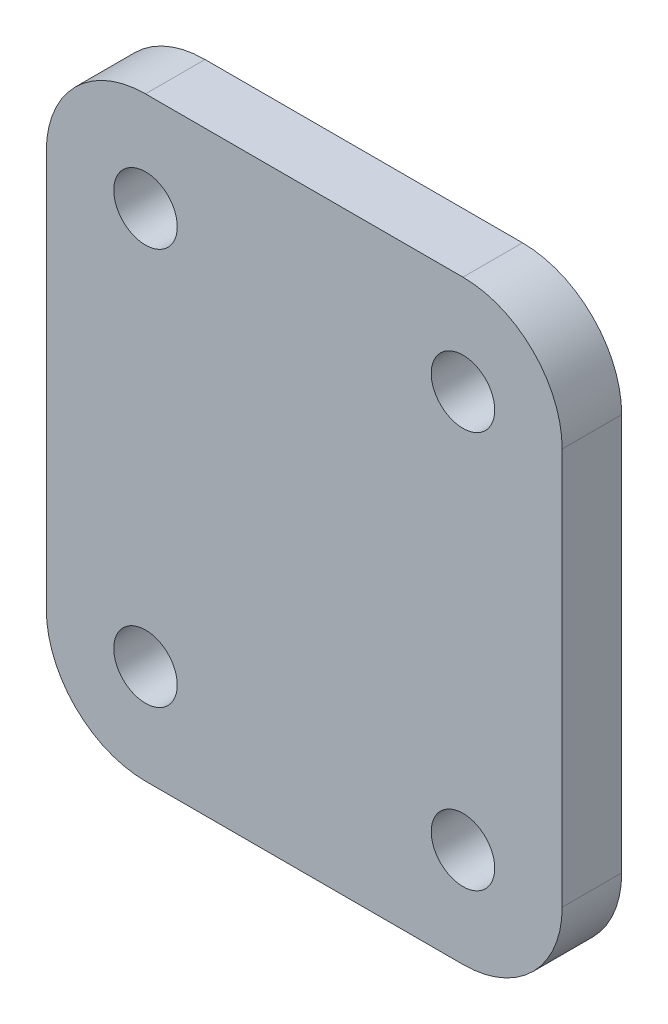
ISO-10303-21;
HEADER;
FILE_DESCRIPTION(('STEP AP214'),'2;1');
FILE_NAME('part.step','',(''),(''),'','','');
FILE_SCHEMA(('AUTOMOTIVE_DESIGN { 1 0 10303 214 1 1 1 1 }'));
ENDSEC;
DATA;
#1=APPLICATION_CONTEXT('core data for automotive mechanical design processes');
#2=APPLICATION_PROTOCOL_DEFINITION('international standard','automotive_design',2000,#1);
#3=PRODUCT_CONTEXT('',#1,'mechanical');
#4=PRODUCT('Part','Part','',(#3));
#5=PRODUCT_RELATED_PRODUCT_CATEGORY('part','',(#4));
#6=PRODUCT_DEFINITION_FORMATION('','',#4);
#7=PRODUCT_DEFINITION_CONTEXT('part definition',#1,'design');
#8=PRODUCT_DEFINITION('design','',#6,#7);
#9=PRODUCT_DEFINITION_SHAPE('','',#8);
#10=(LENGTH_UNIT() NAMED_UNIT(*) SI_UNIT(.MILLI.,.METRE.));
#11=(NAMED_UNIT(*) PLANE_ANGLE_UNIT() SI_UNIT($,.RADIAN.));
#12=(NAMED_UNIT(*) SI_UNIT($,.STERADIAN.) SOLID_ANGLE_UNIT());
#13=UNCERTAINTY_MEASURE_WITH_UNIT(LENGTH_MEASURE(1.E-05),#10,'distance_accuracy_value','');
#14=(GEOMETRIC_REPRESENTATION_CONTEXT(3) GLOBAL_UNCERTAINTY_ASSIGNED_CONTEXT((#13)) GLOBAL_UNIT_ASSIGNED_CONTEXT((#10,
#11,#12)) REPRESENTATION_CONTEXT('',''));
#15=CARTESIAN_POINT('',(0.,0.,0.));
#16=DIRECTION('',(0.,0.,1.));
#17=DIRECTION('',(1.,0.,0.));
#18=AXIS2_PLACEMENT_3D('',#15,#16,#17);
#19=CARTESIAN_POINT('',(0.,-15.,3.));
#20=DIRECTION('',(0.,1.,0.));
#21=DIRECTION('',(-1.,0.,0.));
#22=AXIS2_PLACEMENT_3D('',#19,#20,#21);
#23=PLANE('',#22);
#24=DIRECTION('',(1.,0.,0.));
#25=VECTOR('',#24,1.);
#26=CARTESIAN_POINT('',(0.,-15.,3.));
#27=LINE('',#26,#25);
#28=CARTESIAN_POINT('',(-7.99999999999999,-15.,3.));
#29=VERTEX_POINT('',#28);
#30=CARTESIAN_POINT('',(8.,-15.,3.));
#31=VERTEX_POINT('',#30);
#32=EDGE_CURVE('E123',#29,#31,#27,.T.);
#33=ORIENTED_EDGE('',*,*,#32,.F.);
#34=DIRECTION('',(0.,0.,-1.));
#35=VECTOR('',#34,1.);
#36=CARTESIAN_POINT('',(-7.99999999999999,-15.,0.));
#37=LINE('',#36,#35);
#38=CARTESIAN_POINT('',(-7.99999999999999,-15.,0.));
#39=VERTEX_POINT('',#38);
#40=EDGE_CURVE('E108',#29,#39,#37,.T.);
#41=ORIENTED_EDGE('',*,*,#40,.T.);
#42=DIRECTION('',(1.,0.,0.));
#43=VECTOR('',#42,1.);
#44=CARTESIAN_POINT('',(0.,-15.,0.));
#45=LINE('',#44,#43);
#46=CARTESIAN_POINT('',(8.,-15.,0.));
#47=VERTEX_POINT('',#46);
#48=EDGE_CURVE('E120',#39,#47,#45,.T.);
#49=ORIENTED_EDGE('',*,*,#48,.T.);
#50=DIRECTION('',(0.,0.,-1.));
#51=VECTOR('',#50,1.);
#52=CARTESIAN_POINT('',(8.,-15.,3.));
#53=LINE('',#52,#51);
#54=EDGE_CURVE('E125',#47,#31,#53,.F.);
#55=ORIENTED_EDGE('',*,*,#54,.T.);
#56=EDGE_LOOP('',(#33,#41,#49,#55));
#57=FACE_BOUND('',#56,.T.);
#58=ADVANCED_FACE('F39',(#57),#23,.F.);
#59=CARTESIAN_POINT('',(13.,0.,3.));
#60=DIRECTION('',(-1.,0.,0.));
#61=DIRECTION('',(0.,0.,1.));
#62=AXIS2_PLACEMENT_3D('',#59,#60,#61);
#63=PLANE('',#62);
#64=DIRECTION('',(0.,1.,0.));
#65=VECTOR('',#64,1.);
#66=CARTESIAN_POINT('',(13.,0.,3.));
#67=LINE('',#66,#65);
#68=CARTESIAN_POINT('',(13.,-10.,3.));
#69=VERTEX_POINT('',#68);
#70=CARTESIAN_POINT('',(13.,10.,3.));
#71=VERTEX_POINT('',#70);
#72=EDGE_CURVE('E190',#69,#71,#67,.T.);
#73=ORIENTED_EDGE('',*,*,#72,.F.);
#74=DIRECTION('',(0.,0.,-1.));
#75=VECTOR('',#74,1.);
#76=CARTESIAN_POINT('',(13.,-10.,3.));
#77=LINE('',#76,#75);
#78=CARTESIAN_POINT('',(13.,-10.,0.));
#79=VERTEX_POINT('',#78);
#80=EDGE_CURVE('E170',#69,#79,#77,.T.);
#81=ORIENTED_EDGE('',*,*,#80,.T.);
#82=DIRECTION('',(0.,1.,0.));
#83=VECTOR('',#82,1.);
#84=CARTESIAN_POINT('',(13.,0.,0.));
#85=LINE('',#84,#83);
#86=CARTESIAN_POINT('',(13.,10.,0.));
#87=VERTEX_POINT('',#86);
#88=EDGE_CURVE('E130',#79,#87,#85,.T.);
#89=ORIENTED_EDGE('',*,*,#88,.T.);
#90=DIRECTION('',(0.,0.,-1.));
#91=VECTOR('',#90,1.);
#92=CARTESIAN_POINT('',(13.,10.,3.));
#93=LINE('',#92,#91);
#94=EDGE_CURVE('E168',#87,#71,#93,.F.);
#95=ORIENTED_EDGE('',*,*,#94,.T.);
#96=EDGE_LOOP('',(#73,#81,#89,#95));
#97=FACE_BOUND('',#96,.T.);
#98=ADVANCED_FACE('F222',(#97),#63,.F.);
#99=CARTESIAN_POINT('',(0.,15.,3.));
#100=DIRECTION('',(0.,1.,0.));
#101=DIRECTION('',(-1.,0.,0.));
#102=AXIS2_PLACEMENT_3D('',#99,#100,#101);
#103=PLANE('',#102);
#104=DIRECTION('',(1.,0.,0.));
#105=VECTOR('',#104,1.);
#106=CARTESIAN_POINT('',(0.,15.,0.));
#107=LINE('',#106,#105);
#108=CARTESIAN_POINT('',(-8.,15.,0.));
#109=VERTEX_POINT('',#108);
#110=CARTESIAN_POINT('',(8.,15.,0.));
#111=VERTEX_POINT('',#110);
#112=EDGE_CURVE('E134',#109,#111,#107,.T.);
#113=ORIENTED_EDGE('',*,*,#112,.F.);
#114=DIRECTION('',(0.,0.,-1.));
#115=VECTOR('',#114,1.);
#116=CARTESIAN_POINT('',(-8.,15.,3.));
#117=LINE('',#116,#115);
#118=CARTESIAN_POINT('',(-8.,15.,3.));
#119=VERTEX_POINT('',#118);
#120=EDGE_CURVE('E11',#109,#119,#117,.F.);
#121=ORIENTED_EDGE('',*,*,#120,.T.);
#122=DIRECTION('',(1.,0.,0.));
#123=VECTOR('',#122,1.);
#124=CARTESIAN_POINT('',(0.,15.,3.));
#125=LINE('',#124,#123);
#126=CARTESIAN_POINT('',(8.,15.,3.));
#127=VERTEX_POINT('',#126);
#128=EDGE_CURVE('E175',#119,#127,#125,.T.);
#129=ORIENTED_EDGE('',*,*,#128,.T.);
#130=DIRECTION('',(0.,0.,-1.));
#131=VECTOR('',#130,1.);
#132=CARTESIAN_POINT('',(8.,15.,0.));
#133=LINE('',#132,#131);
#134=EDGE_CURVE('E47',#127,#111,#133,.T.);
#135=ORIENTED_EDGE('',*,*,#134,.T.);
#136=EDGE_LOOP('',(#113,#121,#129,#135));
#137=FACE_BOUND('',#136,.T.);
#138=ADVANCED_FACE('F174',(#137),#103,.T.);
#139=CARTESIAN_POINT('',(8.,-10.,3.));
#140=DIRECTION('',(0.,0.,-1.));
#141=DIRECTION('',(-1.,0.,0.));
#142=AXIS2_PLACEMENT_3D('',#139,#140,#141);
#143=CYLINDRICAL_SURFACE('',#142,1.6);
#144=CARTESIAN_POINT('',(8.,-10.,3.));
#145=DIRECTION('',(0.,0.,1.));
#146=DIRECTION('',(1.,0.,0.));
#147=AXIS2_PLACEMENT_3D('',#144,#145,#146);
#148=CIRCLE('',#147,1.6);
#149=CARTESIAN_POINT('',(9.6,-10.,3.));
#150=VERTEX_POINT('',#149);
#151=EDGE_CURVE('E186',#150,#150,#148,.T.);
#152=ORIENTED_EDGE('',*,*,#151,.T.);
#153=EDGE_LOOP('',(#152));
#154=FACE_BOUND('',#153,.T.);
#155=CARTESIAN_POINT('',(8.,-10.,0.));
#156=DIRECTION('',(0.,0.,1.));
#157=DIRECTION('',(1.,0.,0.));
#158=AXIS2_PLACEMENT_3D('',#155,#156,#157);
#159=CIRCLE('',#158,1.6);
#160=CARTESIAN_POINT('',(9.6,-10.,0.));
#161=VERTEX_POINT('',#160);
#162=EDGE_CURVE('E145',#161,#161,#159,.T.);
#163=ORIENTED_EDGE('',*,*,#162,.F.);
#164=EDGE_LOOP('',(#163));
#165=FACE_BOUND('',#164,.T.);
#166=ADVANCED_FACE('F217',(#154,#165),#143,.F.);
#167=CARTESIAN_POINT('',(-13.,0.,3.));
#168=DIRECTION('',(-1.,0.,0.));
#169=DIRECTION('',(0.,-1.,0.));
#170=AXIS2_PLACEMENT_3D('',#167,#168,#169);
#171=PLANE('',#170);
#172=DIRECTION('',(0.,1.,0.));
#173=VECTOR('',#172,1.);
#174=CARTESIAN_POINT('',(-13.,0.,0.));
#175=LINE('',#174,#173);
#176=CARTESIAN_POINT('',(-13.,-10.,0.));
#177=VERTEX_POINT('',#176);
#178=CARTESIAN_POINT('',(-13.,10.,0.));
#179=VERTEX_POINT('',#178);
#180=EDGE_CURVE('E143',#177,#179,#175,.T.);
#181=ORIENTED_EDGE('',*,*,#180,.F.);
#182=DIRECTION('',(0.,0.,-1.));
#183=VECTOR('',#182,1.);
#184=CARTESIAN_POINT('',(-13.,-10.,3.));
#185=LINE('',#184,#183);
#186=CARTESIAN_POINT('',(-13.,-10.,3.));
#187=VERTEX_POINT('',#186);
#188=EDGE_CURVE('E109',#177,#187,#185,.F.);
#189=ORIENTED_EDGE('',*,*,#188,.T.);
#190=DIRECTION('',(0.,1.,0.));
#191=VECTOR('',#190,1.);
#192=CARTESIAN_POINT('',(-13.,0.,3.));
#193=LINE('',#192,#191);
#194=CARTESIAN_POINT('',(-13.,10.,3.));
#195=VERTEX_POINT('',#194);
#196=EDGE_CURVE('E185',#187,#195,#193,.T.);
#197=ORIENTED_EDGE('',*,*,#196,.T.);
#198=DIRECTION('',(0.,0.,-1.));
#199=VECTOR('',#198,1.);
#200=CARTESIAN_POINT('',(-13.,10.,3.));
#201=LINE('',#200,#199);
#202=EDGE_CURVE('E114',#195,#179,#201,.T.);
#203=ORIENTED_EDGE('',*,*,#202,.T.);
#204=EDGE_LOOP('',(#181,#189,#197,#203));
#205=FACE_BOUND('',#204,.T.);
#206=ADVANCED_FACE('F183',(#205),#171,.T.);
#207=CARTESIAN_POINT('',(-8.,10.,3.));
#208=DIRECTION('',(0.,0.,-1.));
#209=DIRECTION('',(-1.,0.,0.));
#210=AXIS2_PLACEMENT_3D('',#207,#208,#209);
#211=CYLINDRICAL_SURFACE('',#210,1.6);
#212=CARTESIAN_POINT('',(-8.,10.,3.));
#213=DIRECTION('',(0.,0.,1.));
#214=DIRECTION('',(1.,0.,0.));
#215=AXIS2_PLACEMENT_3D('',#212,#213,#214);
#216=CIRCLE('',#215,1.6);
#217=CARTESIAN_POINT('',(-6.4,10.,3.));
#218=VERTEX_POINT('',#217);
#219=EDGE_CURVE('E245',#218,#218,#216,.T.);
#220=ORIENTED_EDGE('',*,*,#219,.T.);
#221=EDGE_LOOP('',(#220));
#222=FACE_BOUND('',#221,.T.);
#223=CARTESIAN_POINT('',(-8.,10.,0.));
#224=DIRECTION('',(0.,0.,1.));
#225=DIRECTION('',(1.,0.,0.));
#226=AXIS2_PLACEMENT_3D('',#223,#224,#225);
#227=CIRCLE('',#226,1.6);
#228=CARTESIAN_POINT('',(-6.4,10.,0.));
#229=VERTEX_POINT('',#228);
#230=EDGE_CURVE('E131',#229,#229,#227,.T.);
#231=ORIENTED_EDGE('',*,*,#230,.F.);
#232=EDGE_LOOP('',(#231));
#233=FACE_BOUND('',#232,.T.);
#234=ADVANCED_FACE('F206',(#222,#233),#211,.F.);
#235=CARTESIAN_POINT('',(8.,10.,3.));
#236=DIRECTION('',(0.,0.,-1.));
#237=DIRECTION('',(-1.,0.,0.));
#238=AXIS2_PLACEMENT_3D('',#235,#236,#237);
#239=CYLINDRICAL_SURFACE('',#238,1.6);
#240=CARTESIAN_POINT('',(8.,10.,3.));
#241=DIRECTION('',(0.,0.,1.));
#242=DIRECTION('',(1.,0.,0.));
#243=AXIS2_PLACEMENT_3D('',#240,#241,#242);
#244=CIRCLE('',#243,1.6);
#245=CARTESIAN_POINT('',(9.6,10.,3.));
#246=VERTEX_POINT('',#245);
#247=EDGE_CURVE('E151',#246,#246,#244,.F.);
#248=ORIENTED_EDGE('',*,*,#247,.F.);
#249=EDGE_LOOP('',(#248));
#250=FACE_BOUND('',#249,.T.);
#251=CARTESIAN_POINT('',(8.,10.,0.));
#252=DIRECTION('',(0.,0.,1.));
#253=DIRECTION('',(1.,0.,0.));
#254=AXIS2_PLACEMENT_3D('',#251,#252,#253);
#255=CIRCLE('',#254,1.6);
#256=CARTESIAN_POINT('',(9.6,10.,0.));
#257=VERTEX_POINT('',#256);
#258=EDGE_CURVE('E137',#257,#257,#255,.F.);
#259=ORIENTED_EDGE('',*,*,#258,.T.);
#260=EDGE_LOOP('',(#259));
#261=FACE_BOUND('',#260,.T.);
#262=ADVANCED_FACE('F198',(#250,#261),#239,.F.);
#263=CARTESIAN_POINT('',(-8.,-10.,3.));
#264=DIRECTION('',(0.,0.,-1.));
#265=DIRECTION('',(-1.,0.,0.));
#266=AXIS2_PLACEMENT_3D('',#263,#264,#265);
#267=CYLINDRICAL_SURFACE('',#266,1.6);
#268=CARTESIAN_POINT('',(-8.,-10.,3.));
#269=DIRECTION('',(0.,0.,1.));
#270=DIRECTION('',(1.,0.,0.));
#271=AXIS2_PLACEMENT_3D('',#268,#269,#270);
#272=CIRCLE('',#271,1.6);
#273=CARTESIAN_POINT('',(-6.4,-10.,3.));
#274=VERTEX_POINT('',#273);
#275=EDGE_CURVE('E152',#274,#274,#272,.F.);
#276=ORIENTED_EDGE('',*,*,#275,.F.);
#277=EDGE_LOOP('',(#276));
#278=FACE_BOUND('',#277,.T.);
#279=CARTESIAN_POINT('',(-8.,-10.,0.));
#280=DIRECTION('',(0.,0.,1.));
#281=DIRECTION('',(1.,0.,0.));
#282=AXIS2_PLACEMENT_3D('',#279,#280,#281);
#283=CIRCLE('',#282,1.6);
#284=CARTESIAN_POINT('',(-6.4,-10.,0.));
#285=VERTEX_POINT('',#284);
#286=EDGE_CURVE('E148',#285,#285,#283,.F.);
#287=ORIENTED_EDGE('',*,*,#286,.T.);
#288=EDGE_LOOP('',(#287));
#289=FACE_BOUND('',#288,.T.);
#290=ADVANCED_FACE('F214',(#278,#289),#267,.F.);
#291=CARTESIAN_POINT('',(0.,0.,3.));
#292=DIRECTION('',(0.,0.,1.));
#293=DIRECTION('',(1.,0.,0.));
#294=AXIS2_PLACEMENT_3D('',#291,#292,#293);
#295=PLANE('',#294);
#296=ORIENTED_EDGE('',*,*,#247,.T.);
#297=EDGE_LOOP('',(#296));
#298=FACE_BOUND('',#297,.T.);
#299=ORIENTED_EDGE('',*,*,#219,.F.);
#300=EDGE_LOOP('',(#299));
#301=FACE_BOUND('',#300,.T.);
#302=ORIENTED_EDGE('',*,*,#196,.F.);
#303=CARTESIAN_POINT('',(-7.99999999999999,-10.,3.));
#304=DIRECTION('',(0.,0.,1.));
#305=DIRECTION('',(1.,0.,0.));
#306=AXIS2_PLACEMENT_3D('',#303,#304,#305);
#307=CIRCLE('',#306,5.);
#308=EDGE_CURVE('E166',#187,#29,#307,.T.);
#309=ORIENTED_EDGE('',*,*,#308,.T.);
#310=ORIENTED_EDGE('',*,*,#32,.T.);
#311=CARTESIAN_POINT('',(8.,-10.,3.));
#312=DIRECTION('',(0.,0.,1.));
#313=DIRECTION('',(1.,0.,0.));
#314=AXIS2_PLACEMENT_3D('',#311,#312,#313);
#315=CIRCLE('',#314,5.);
#316=EDGE_CURVE('E164',#31,#69,#315,.T.);
#317=ORIENTED_EDGE('',*,*,#316,.T.);
#318=ORIENTED_EDGE('',*,*,#72,.T.);
#319=CARTESIAN_POINT('',(8.,10.,3.));
#320=DIRECTION('',(0.,0.,1.));
#321=DIRECTION('',(1.,0.,0.));
#322=AXIS2_PLACEMENT_3D('',#319,#320,#321);
#323=CIRCLE('',#322,5.);
#324=EDGE_CURVE('E54',#71,#127,#323,.T.);
#325=ORIENTED_EDGE('',*,*,#324,.T.);
#326=ORIENTED_EDGE('',*,*,#128,.F.);
#327=CARTESIAN_POINT('',(-8.,10.,3.));
#328=DIRECTION('',(0.,0.,1.));
#329=DIRECTION('',(1.,0.,0.));
#330=AXIS2_PLACEMENT_3D('',#327,#328,#329);
#331=CIRCLE('',#330,5.);
#332=EDGE_CURVE('E162',#119,#195,#331,.T.);
#333=ORIENTED_EDGE('',*,*,#332,.T.);
#334=EDGE_LOOP('',(#302,#309,#310,#317,#318,#325,#326,#333));
#335=FACE_BOUND('',#334,.T.);
#336=ORIENTED_EDGE('',*,*,#151,.F.);
#337=EDGE_LOOP('',(#336));
#338=FACE_BOUND('',#337,.T.);
#339=ORIENTED_EDGE('',*,*,#275,.T.);
#340=EDGE_LOOP('',(#339));
#341=FACE_BOUND('',#340,.T.);
#342=ADVANCED_FACE('F202',(#298,#301,#335,#338,#341),#295,.T.);
#343=CARTESIAN_POINT('',(0.,0.,0.));
#344=DIRECTION('',(0.,0.,1.));
#345=DIRECTION('',(1.,0.,0.));
#346=AXIS2_PLACEMENT_3D('',#343,#344,#345);
#347=PLANE('',#346);
#348=ORIENTED_EDGE('',*,*,#258,.F.);
#349=EDGE_LOOP('',(#348));
#350=FACE_BOUND('',#349,.T.);
#351=ORIENTED_EDGE('',*,*,#230,.T.);
#352=EDGE_LOOP('',(#351));
#353=FACE_BOUND('',#352,.T.);
#354=ORIENTED_EDGE('',*,*,#48,.F.);
#355=CARTESIAN_POINT('',(-7.99999999999999,-10.,0.));
#356=DIRECTION('',(0.,0.,1.));
#357=DIRECTION('',(1.,0.,0.));
#358=AXIS2_PLACEMENT_3D('',#355,#356,#357);
#359=CIRCLE('',#358,5.);
#360=EDGE_CURVE('E104',#39,#177,#359,.F.);
#361=ORIENTED_EDGE('',*,*,#360,.T.);
#362=ORIENTED_EDGE('',*,*,#180,.T.);
#363=CARTESIAN_POINT('',(-8.,10.,0.));
#364=DIRECTION('',(0.,0.,1.));
#365=DIRECTION('',(1.,0.,0.));
#366=AXIS2_PLACEMENT_3D('',#363,#364,#365);
#367=CIRCLE('',#366,5.);
#368=EDGE_CURVE('E155',#179,#109,#367,.F.);
#369=ORIENTED_EDGE('',*,*,#368,.T.);
#370=ORIENTED_EDGE('',*,*,#112,.T.);
#371=CARTESIAN_POINT('',(8.,10.,0.));
#372=DIRECTION('',(0.,0.,1.));
#373=DIRECTION('',(1.,0.,0.));
#374=AXIS2_PLACEMENT_3D('',#371,#372,#373);
#375=CIRCLE('',#374,5.);
#376=EDGE_CURVE('E124',#111,#87,#375,.F.);
#377=ORIENTED_EDGE('',*,*,#376,.T.);
#378=ORIENTED_EDGE('',*,*,#88,.F.);
#379=CARTESIAN_POINT('',(8.,-10.,0.));
#380=DIRECTION('',(0.,0.,1.));
#381=DIRECTION('',(1.,0.,0.));
#382=AXIS2_PLACEMENT_3D('',#379,#380,#381);
#383=CIRCLE('',#382,5.);
#384=EDGE_CURVE('E115',#79,#47,#383,.F.);
#385=ORIENTED_EDGE('',*,*,#384,.T.);
#386=EDGE_LOOP('',(#354,#361,#362,#369,#370,#377,#378,#385));
#387=FACE_BOUND('',#386,.T.);
#388=ORIENTED_EDGE('',*,*,#162,.T.);
#389=EDGE_LOOP('',(#388));
#390=FACE_BOUND('',#389,.T.);
#391=ORIENTED_EDGE('',*,*,#286,.F.);
#392=EDGE_LOOP('',(#391));
#393=FACE_BOUND('',#392,.T.);
#394=ADVANCED_FACE('F127',(#350,#353,#387,#390,#393),#347,.F.);
#395=CARTESIAN_POINT('',(-7.99999999999999,-10.,3.));
#396=DIRECTION('',(0.,0.,1.));
#397=DIRECTION('',(1.,0.,0.));
#398=AXIS2_PLACEMENT_3D('',#395,#396,#397);
#399=CYLINDRICAL_SURFACE('',#398,5.);
#400=ORIENTED_EDGE('',*,*,#308,.F.);
#401=ORIENTED_EDGE('',*,*,#188,.F.);
#402=ORIENTED_EDGE('',*,*,#360,.F.);
#403=ORIENTED_EDGE('',*,*,#40,.F.);
#404=EDGE_LOOP('',(#400,#401,#402,#403));
#405=FACE_BOUND('',#404,.T.);
#406=ADVANCED_FACE('F107',(#405),#399,.T.);
#407=CARTESIAN_POINT('',(8.,-10.,3.));
#408=DIRECTION('',(0.,0.,-1.));
#409=DIRECTION('',(-1.,0.,0.));
#410=AXIS2_PLACEMENT_3D('',#407,#408,#409);
#411=CYLINDRICAL_SURFACE('',#410,5.);
#412=ORIENTED_EDGE('',*,*,#316,.F.);
#413=ORIENTED_EDGE('',*,*,#54,.F.);
#414=ORIENTED_EDGE('',*,*,#384,.F.);
#415=ORIENTED_EDGE('',*,*,#80,.F.);
#416=EDGE_LOOP('',(#412,#413,#414,#415));
#417=FACE_BOUND('',#416,.T.);
#418=ADVANCED_FACE('F263',(#417),#411,.T.);
#419=CARTESIAN_POINT('',(-8.,10.,3.));
#420=DIRECTION('',(0.,0.,-1.));
#421=DIRECTION('',(-1.,0.,0.));
#422=AXIS2_PLACEMENT_3D('',#419,#420,#421);
#423=CYLINDRICAL_SURFACE('',#422,5.);
#424=ORIENTED_EDGE('',*,*,#332,.F.);
#425=ORIENTED_EDGE('',*,*,#120,.F.);
#426=ORIENTED_EDGE('',*,*,#368,.F.);
#427=ORIENTED_EDGE('',*,*,#202,.F.);
#428=EDGE_LOOP('',(#424,#425,#426,#427));
#429=FACE_BOUND('',#428,.T.);
#430=ADVANCED_FACE('F180',(#429),#423,.T.);
#431=CARTESIAN_POINT('',(8.,10.,3.));
#432=DIRECTION('',(0.,0.,1.));
#433=DIRECTION('',(1.,0.,0.));
#434=AXIS2_PLACEMENT_3D('',#431,#432,#433);
#435=CYLINDRICAL_SURFACE('',#434,5.);
#436=ORIENTED_EDGE('',*,*,#324,.F.);
#437=ORIENTED_EDGE('',*,*,#94,.F.);
#438=ORIENTED_EDGE('',*,*,#376,.F.);
#439=ORIENTED_EDGE('',*,*,#134,.F.);
#440=EDGE_LOOP('',(#436,#437,#438,#439));
#441=FACE_BOUND('',#440,.T.);
#442=ADVANCED_FACE('F41',(#441),#435,.T.);
#443=CLOSED_SHELL('',(#58,#98,#138,#166,#206,#234,#262,#290,#342,#394,#406,#418,#430,#442));
#444=MANIFOLD_SOLID_BREP('B2',#443);
#445=ADVANCED_BREP_SHAPE_REPRESENTATION('',(#18,#444),#14);
#446=SHAPE_DEFINITION_REPRESENTATION(#9,#445);
ENDSEC;
END-ISO-10303-21;
